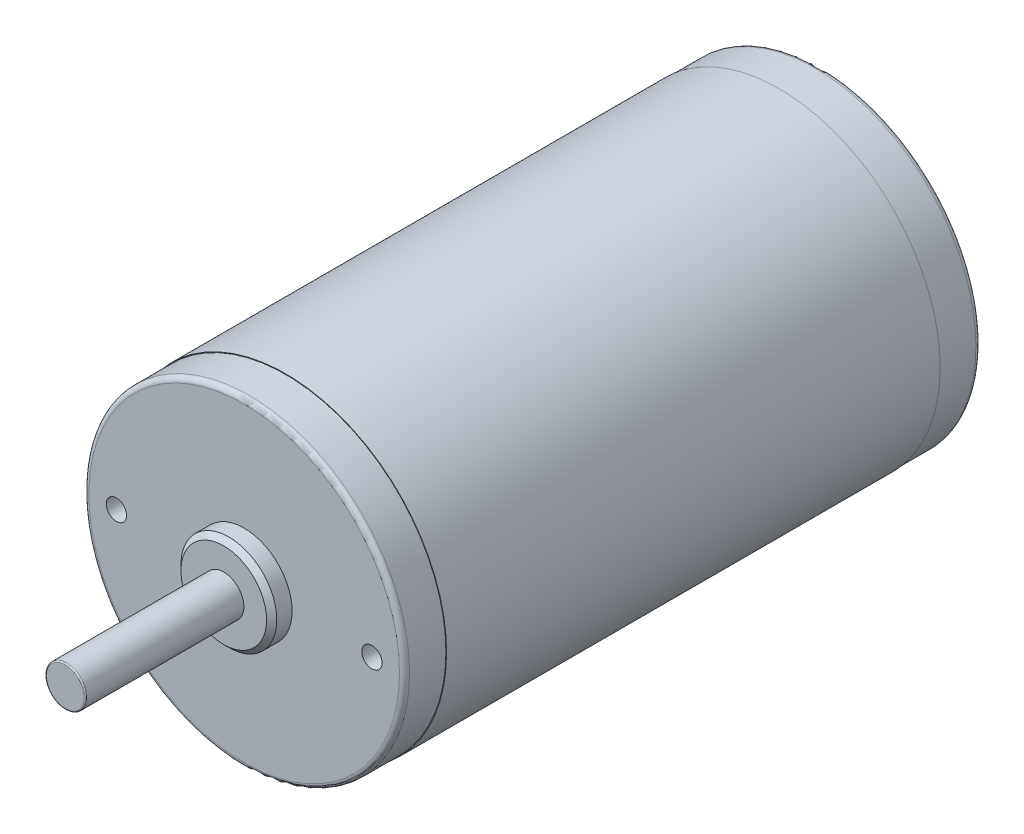
ISO-10303-21;
HEADER;
FILE_DESCRIPTION(('STEP AP214'),'2;1');
FILE_NAME('part.step','',(''),(''),'','','');
FILE_SCHEMA(('AUTOMOTIVE_DESIGN { 1 0 10303 214 1 1 1 1 }'));
ENDSEC;
DATA;
#1=APPLICATION_CONTEXT('core data for automotive mechanical design processes');
#2=APPLICATION_PROTOCOL_DEFINITION('international standard','automotive_design',2000,#1);
#3=PRODUCT_CONTEXT('',#1,'mechanical');
#4=PRODUCT('Part','Part','',(#3));
#5=PRODUCT_RELATED_PRODUCT_CATEGORY('part','',(#4));
#6=PRODUCT_DEFINITION_FORMATION('','',#4);
#7=PRODUCT_DEFINITION_CONTEXT('part definition',#1,'design');
#8=PRODUCT_DEFINITION('design','',#6,#7);
#9=PRODUCT_DEFINITION_SHAPE('','',#8);
#10=(LENGTH_UNIT() NAMED_UNIT(*) SI_UNIT(.MILLI.,.METRE.));
#11=(NAMED_UNIT(*) PLANE_ANGLE_UNIT() SI_UNIT($,.RADIAN.));
#12=(NAMED_UNIT(*) SI_UNIT($,.STERADIAN.) SOLID_ANGLE_UNIT());
#13=UNCERTAINTY_MEASURE_WITH_UNIT(LENGTH_MEASURE(1.E-05),#10,'distance_accuracy_value','');
#14=(GEOMETRIC_REPRESENTATION_CONTEXT(3) GLOBAL_UNCERTAINTY_ASSIGNED_CONTEXT((#13)) GLOBAL_UNIT_ASSIGNED_CONTEXT((#10,
#11,#12)) REPRESENTATION_CONTEXT('',''));
#15=CARTESIAN_POINT('',(0.,0.,0.));
#16=DIRECTION('',(0.,0.,1.));
#17=DIRECTION('',(1.,0.,0.));
#18=AXIS2_PLACEMENT_3D('',#15,#16,#17);
#19=CARTESIAN_POINT('',(35.56,109.2962,-95.5547999999977));
#20=DIRECTION('',(0.,0.,-0.999999999999999));
#21=DIRECTION('',(-1.,0.,0.));
#22=AXIS2_PLACEMENT_3D('',#19,#20,#21);
#23=PLANE('',#22);
#24=CARTESIAN_POINT('',(35.56,109.2962,-95.5547999999977));
#25=DIRECTION('',(0.,0.,-0.999999999999999));
#26=DIRECTION('',(-1.,0.,0.));
#27=AXIS2_PLACEMENT_3D('',#24,#25,#26);
#28=CIRCLE('',#27,30.8770000000005);
#29=CARTESIAN_POINT('',(4.68299999999951,109.2962,-95.5547999999977));
#30=VERTEX_POINT('',#29);
#31=EDGE_CURVE('E104',#30,#30,#28,.T.);
#32=ORIENTED_EDGE('',*,*,#31,.T.);
#33=EDGE_LOOP('',(#32));
#34=FACE_BOUND('',#33,.T.);
#35=CARTESIAN_POINT('',(35.56,109.2962,-95.5547999999977));
#36=DIRECTION('',(0.,0.,-0.999999999999999));
#37=DIRECTION('',(-1.,0.,0.));
#38=AXIS2_PLACEMENT_3D('',#35,#36,#37);
#39=CIRCLE('',#38,15.0368000000003);
#40=CARTESIAN_POINT('',(20.5231999999997,109.2962,-95.5547999999977));
#41=VERTEX_POINT('',#40);
#42=EDGE_CURVE('E71',#41,#41,#39,.T.);
#43=ORIENTED_EDGE('',*,*,#42,.F.);
#44=EDGE_LOOP('',(#43));
#45=FACE_BOUND('',#44,.T.);
#46=ADVANCED_FACE('F36',(#34,#45),#23,.T.);
#47=CARTESIAN_POINT('',(35.56,109.2962,-87.3251999999978));
#48=DIRECTION('',(0.,0.,-0.999999999999999));
#49=DIRECTION('',(-1.,0.,0.));
#50=AXIS2_PLACEMENT_3D('',#47,#48,#49);
#51=PLANE('',#50);
#52=CARTESIAN_POINT('',(35.56,109.2962,-87.3251999999978));
#53=DIRECTION('',(0.,0.,-0.999999999999999));
#54=DIRECTION('',(-1.,0.,0.));
#55=AXIS2_PLACEMENT_3D('',#52,#53,#54);
#56=CIRCLE('',#55,32.0040000000005);
#57=CARTESIAN_POINT('',(3.55599999999952,109.2962,-87.3251999999978));
#58=VERTEX_POINT('',#57);
#59=EDGE_CURVE('E83',#58,#58,#56,.T.);
#60=ORIENTED_EDGE('',*,*,#59,.T.);
#61=EDGE_LOOP('',(#60));
#62=FACE_BOUND('',#61,.T.);
#63=CARTESIAN_POINT('',(35.56,109.2962,-87.3251999999978));
#64=DIRECTION('',(0.,0.,-0.999999999999999));
#65=DIRECTION('',(-1.,0.,0.));
#66=AXIS2_PLACEMENT_3D('',#63,#64,#65);
#67=CIRCLE('',#66,31.8770000000005);
#68=CARTESIAN_POINT('',(3.68299999999951,109.2962,-87.3251999999978));
#69=VERTEX_POINT('',#68);
#70=EDGE_CURVE('E74',#69,#69,#67,.T.);
#71=ORIENTED_EDGE('',*,*,#70,.F.);
#72=EDGE_LOOP('',(#71));
#73=FACE_BOUND('',#72,.T.);
#74=ADVANCED_FACE('F130',(#62,#73),#51,.T.);
#75=CARTESIAN_POINT('',(35.56,109.2962,23.1140000000001));
#76=DIRECTION('',(0.,0.,0.999999999999999));
#77=DIRECTION('',(1.,0.,0.));
#78=AXIS2_PLACEMENT_3D('',#75,#76,#77);
#79=PLANE('',#78);
#80=CARTESIAN_POINT('',(35.56,109.2962,23.1140000000001));
#81=DIRECTION('',(0.,0.,0.999999999999999));
#82=DIRECTION('',(1.,0.,0.));
#83=AXIS2_PLACEMENT_3D('',#80,#81,#82);
#84=CIRCLE('',#83,8.50900000182338);
#85=CARTESIAN_POINT('',(44.0690000018234,109.2962,23.1140000000001));
#86=VERTEX_POINT('',#85);
#87=EDGE_CURVE('E95',#86,#86,#84,.T.);
#88=ORIENTED_EDGE('',*,*,#87,.T.);
#89=EDGE_LOOP('',(#88));
#90=FACE_BOUND('',#89,.T.);
#91=CARTESIAN_POINT('',(35.56,109.2962,23.1140000000001));
#92=DIRECTION('',(0.,0.,0.999999999999999));
#93=DIRECTION('',(1.,0.,0.));
#94=AXIS2_PLACEMENT_3D('',#91,#92,#93);
#95=CIRCLE('',#94,4.00000000000007);
#96=CARTESIAN_POINT('',(39.5600000000001,109.2962,23.1140000000001));
#97=VERTEX_POINT('',#96);
#98=EDGE_CURVE('E77',#97,#97,#95,.T.);
#99=ORIENTED_EDGE('',*,*,#98,.F.);
#100=EDGE_LOOP('',(#99));
#101=FACE_BOUND('',#100,.T.);
#102=ADVANCED_FACE('F136',(#90,#101),#79,.T.);
#103=CARTESIAN_POINT('',(67.5640000000005,109.2962,10.8204000000007));
#104=DIRECTION('',(0.,0.,0.999999999999999));
#105=DIRECTION('',(1.,0.,0.));
#106=AXIS2_PLACEMENT_3D('',#103,#104,#105);
#107=PLANE('',#106);
#108=CARTESIAN_POINT('',(35.56,109.2962,10.8204000000007));
#109=DIRECTION('',(0.,0.,-0.999999999999999));
#110=DIRECTION('',(-1.,0.,0.));
#111=AXIS2_PLACEMENT_3D('',#108,#109,#110);
#112=CIRCLE('',#111,32.0040000000005);
#113=CARTESIAN_POINT('',(3.55599999999952,109.2962,10.8204000000007));
#114=VERTEX_POINT('',#113);
#115=EDGE_CURVE('E86',#114,#114,#112,.T.);
#116=ORIENTED_EDGE('',*,*,#115,.F.);
#117=EDGE_LOOP('',(#116));
#118=FACE_BOUND('',#117,.T.);
#119=CARTESIAN_POINT('',(35.56,109.2962,10.8204000000007));
#120=DIRECTION('',(0.,0.,0.999999999999999));
#121=DIRECTION('',(1.,0.,0.));
#122=AXIS2_PLACEMENT_3D('',#119,#120,#121);
#123=CIRCLE('',#122,31.8770000000005);
#124=CARTESIAN_POINT('',(67.4370000000005,109.2962,10.8204000000007));
#125=VERTEX_POINT('',#124);
#126=EDGE_CURVE('E80',#125,#125,#123,.T.);
#127=ORIENTED_EDGE('',*,*,#126,.F.);
#128=EDGE_LOOP('',(#127));
#129=FACE_BOUND('',#128,.T.);
#130=ADVANCED_FACE('F159',(#118,#129),#107,.T.);
#131=CARTESIAN_POINT('',(35.56,109.2962,10.8204000000007));
#132=DIRECTION('',(0.,0.,-0.999999999999999));
#133=DIRECTION('',(-1.,0.,0.));
#134=AXIS2_PLACEMENT_3D('',#131,#132,#133);
#135=CYLINDRICAL_SURFACE('',#134,32.0040000000005);
#136=ORIENTED_EDGE('',*,*,#115,.T.);
#137=EDGE_LOOP('',(#136));
#138=FACE_BOUND('',#137,.T.);
#139=ORIENTED_EDGE('',*,*,#59,.F.);
#140=EDGE_LOOP('',(#139));
#141=FACE_BOUND('',#140,.T.);
#142=ADVANCED_FACE('F170',(#138,#141),#135,.T.);
#143=CARTESIAN_POINT('',(35.56,109.2962,19.05));
#144=DIRECTION('',(0.,0.,-0.999999999999999));
#145=DIRECTION('',(-1.,0.,0.));
#146=AXIS2_PLACEMENT_3D('',#143,#144,#145);
#147=CYLINDRICAL_SURFACE('',#146,31.8770000000005);
#148=CARTESIAN_POINT('',(35.56,109.2962,18.0499999999999));
#149=DIRECTION('',(0.,0.,0.999999999999999));
#150=DIRECTION('',(1.,0.,0.));
#151=AXIS2_PLACEMENT_3D('',#148,#149,#150);
#152=CIRCLE('',#151,31.8770000000005);
#153=CARTESIAN_POINT('',(67.4370000000005,109.2962,18.0499999999999));
#154=VERTEX_POINT('',#153);
#155=EDGE_CURVE('E113',#154,#154,#152,.F.);
#156=ORIENTED_EDGE('',*,*,#155,.T.);
#157=EDGE_LOOP('',(#156));
#158=FACE_BOUND('',#157,.T.);
#159=ORIENTED_EDGE('',*,*,#126,.T.);
#160=EDGE_LOOP('',(#159));
#161=FACE_BOUND('',#160,.T.);
#162=ADVANCED_FACE('F167',(#158,#161),#147,.T.);
#163=CARTESIAN_POINT('',(35.56,109.2962,19.05));
#164=DIRECTION('',(0.,0.,0.999999999999999));
#165=DIRECTION('',(1.,0.,0.));
#166=AXIS2_PLACEMENT_3D('',#163,#164,#165);
#167=PLANE('',#166);
#168=CARTESIAN_POINT('',(35.56,109.2962,19.05));
#169=DIRECTION('',(0.,0.,0.999999999999999));
#170=DIRECTION('',(1.,0.,0.));
#171=AXIS2_PLACEMENT_3D('',#168,#169,#170);
#172=CIRCLE('',#171,30.8770000000005);
#173=CARTESIAN_POINT('',(66.4370000000005,109.2962,19.05));
#174=VERTEX_POINT('',#173);
#175=EDGE_CURVE('E110',#174,#174,#172,.T.);
#176=ORIENTED_EDGE('',*,*,#175,.T.);
#177=EDGE_LOOP('',(#176));
#178=FACE_BOUND('',#177,.T.);
#179=CARTESIAN_POINT('',(10.1599999999994,109.2962,19.05));
#180=DIRECTION('',(0.,0.,0.999999999999999));
#181=DIRECTION('',(1.,0.,0.));
#182=AXIS2_PLACEMENT_3D('',#179,#180,#181);
#183=CIRCLE('',#182,2.01930000000003);
#184=CARTESIAN_POINT('',(12.1792999999994,109.2962,19.05));
#185=VERTEX_POINT('',#184);
#186=EDGE_CURVE('E61',#185,#185,#183,.T.);
#187=ORIENTED_EDGE('',*,*,#186,.F.);
#188=EDGE_LOOP('',(#187));
#189=FACE_BOUND('',#188,.T.);
#190=CARTESIAN_POINT('',(60.96,109.2962,19.05));
#191=DIRECTION('',(0.,0.,0.999999999999999));
#192=DIRECTION('',(1.,0.,0.));
#193=AXIS2_PLACEMENT_3D('',#190,#191,#192);
#194=CIRCLE('',#193,2.01930000000003);
#195=CARTESIAN_POINT('',(62.9793,109.2962,19.05));
#196=VERTEX_POINT('',#195);
#197=EDGE_CURVE('E60',#196,#196,#194,.T.);
#198=ORIENTED_EDGE('',*,*,#197,.F.);
#199=EDGE_LOOP('',(#198));
#200=FACE_BOUND('',#199,.T.);
#201=CARTESIAN_POINT('',(35.56,109.2962,19.05));
#202=DIRECTION('',(0.,0.,0.999999999999999));
#203=DIRECTION('',(1.,0.,0.));
#204=AXIS2_PLACEMENT_3D('',#201,#202,#203);
#205=CIRCLE('',#204,9.52500000000019);
#206=CARTESIAN_POINT('',(45.0850000000002,109.2962,19.05));
#207=VERTEX_POINT('',#206);
#208=EDGE_CURVE('E89',#207,#207,#205,.T.);
#209=ORIENTED_EDGE('',*,*,#208,.F.);
#210=EDGE_LOOP('',(#209));
#211=FACE_BOUND('',#210,.T.);
#212=ADVANCED_FACE('F163',(#178,#189,#200,#211),#167,.T.);
#213=CARTESIAN_POINT('',(35.56,109.2962,23.1140000000001));
#214=DIRECTION('',(0.,0.,-0.999999999999999));
#215=DIRECTION('',(-1.,0.,0.));
#216=AXIS2_PLACEMENT_3D('',#213,#214,#215);
#217=CYLINDRICAL_SURFACE('',#216,9.52500000000019);
#218=CARTESIAN_POINT('',(35.56,109.2962,22.0979999999995));
#219=DIRECTION('',(0.,0.,0.999999999999999));
#220=DIRECTION('',(1.,0.,0.));
#221=AXIS2_PLACEMENT_3D('',#218,#219,#220);
#222=CIRCLE('',#221,9.52500000000019);
#223=CARTESIAN_POINT('',(45.0850000000002,109.2962,22.0979999999995));
#224=VERTEX_POINT('',#223);
#225=EDGE_CURVE('E92',#224,#224,#222,.F.);
#226=ORIENTED_EDGE('',*,*,#225,.T.);
#227=EDGE_LOOP('',(#226));
#228=FACE_BOUND('',#227,.T.);
#229=ORIENTED_EDGE('',*,*,#208,.T.);
#230=EDGE_LOOP('',(#229));
#231=FACE_BOUND('',#230,.T.);
#232=ADVANCED_FACE('F155',(#228,#231),#217,.T.);
#233=CARTESIAN_POINT('',(35.56,109.2962,54.6139999999999));
#234=DIRECTION('',(0.,0.,-0.999999999999999));
#235=DIRECTION('',(-1.,0.,0.));
#236=AXIS2_PLACEMENT_3D('',#233,#234,#235);
#237=CYLINDRICAL_SURFACE('',#236,4.00000000000007);
#238=CARTESIAN_POINT('',(35.56,109.2962,54.36));
#239=DIRECTION('',(0.,0.,0.999999999999999));
#240=DIRECTION('',(1.,0.,0.));
#241=AXIS2_PLACEMENT_3D('',#238,#239,#240);
#242=CIRCLE('',#241,4.00000000000007);
#243=CARTESIAN_POINT('',(39.5600000000001,109.2962,54.36));
#244=VERTEX_POINT('',#243);
#245=EDGE_CURVE('E101',#244,#244,#242,.F.);
#246=ORIENTED_EDGE('',*,*,#245,.T.);
#247=EDGE_LOOP('',(#246));
#248=FACE_BOUND('',#247,.T.);
#249=ORIENTED_EDGE('',*,*,#98,.T.);
#250=EDGE_LOOP('',(#249));
#251=FACE_BOUND('',#250,.T.);
#252=ADVANCED_FACE('F151',(#248,#251),#237,.T.);
#253=CARTESIAN_POINT('',(35.56,109.2962,54.6139999999999));
#254=DIRECTION('',(0.,0.,0.999999999999999));
#255=DIRECTION('',(1.,0.,0.));
#256=AXIS2_PLACEMENT_3D('',#253,#254,#255);
#257=PLANE('',#256);
#258=CARTESIAN_POINT('',(35.56,109.2962,54.6139999999999));
#259=DIRECTION('',(0.,0.,0.999999999999999));
#260=DIRECTION('',(1.,0.,0.));
#261=AXIS2_PLACEMENT_3D('',#258,#259,#260);
#262=CIRCLE('',#261,3.74600000000007);
#263=CARTESIAN_POINT('',(39.3060000000001,109.2962,54.6139999999999));
#264=VERTEX_POINT('',#263);
#265=EDGE_CURVE('E98',#264,#264,#262,.T.);
#266=ORIENTED_EDGE('',*,*,#265,.T.);
#267=EDGE_LOOP('',(#266));
#268=FACE_BOUND('',#267,.T.);
#269=ADVANCED_FACE('F147',(#268),#257,.T.);
#270=CARTESIAN_POINT('',(35.56,109.2962,-95.5547999999977));
#271=DIRECTION('',(0.,0.,0.999999999999999));
#272=DIRECTION('',(1.,0.,0.));
#273=AXIS2_PLACEMENT_3D('',#270,#271,#272);
#274=CYLINDRICAL_SURFACE('',#273,31.8770000000005);
#275=CARTESIAN_POINT('',(35.56,109.2962,-94.5547999999978));
#276=DIRECTION('',(0.,0.,-0.999999999999999));
#277=DIRECTION('',(-1.,0.,0.));
#278=AXIS2_PLACEMENT_3D('',#275,#276,#277);
#279=CIRCLE('',#278,31.8770000000005);
#280=CARTESIAN_POINT('',(3.68299999999951,109.2962,-94.5547999999978));
#281=VERTEX_POINT('',#280);
#282=EDGE_CURVE('E107',#281,#281,#279,.F.);
#283=ORIENTED_EDGE('',*,*,#282,.T.);
#284=EDGE_LOOP('',(#283));
#285=FACE_BOUND('',#284,.T.);
#286=ORIENTED_EDGE('',*,*,#70,.T.);
#287=EDGE_LOOP('',(#286));
#288=FACE_BOUND('',#287,.T.);
#289=ADVANCED_FACE('F144',(#285,#288),#274,.T.);
#290=CARTESIAN_POINT('',(35.56,109.2962,-100.317299999998));
#291=DIRECTION('',(0.,0.,0.999999999999999));
#292=DIRECTION('',(1.,0.,0.));
#293=AXIS2_PLACEMENT_3D('',#290,#291,#292);
#294=CYLINDRICAL_SURFACE('',#293,15.0368000000003);
#295=CARTESIAN_POINT('',(35.56,109.2962,-99.3172999999978));
#296=DIRECTION('',(0.,0.,-0.999999999999999));
#297=DIRECTION('',(-1.,0.,0.));
#298=AXIS2_PLACEMENT_3D('',#295,#296,#297);
#299=CIRCLE('',#298,15.0368000000003);
#300=CARTESIAN_POINT('',(20.5231999999997,109.2962,-99.3172999999978));
#301=VERTEX_POINT('',#300);
#302=EDGE_CURVE('E11',#301,#301,#299,.F.);
#303=ORIENTED_EDGE('',*,*,#302,.T.);
#304=EDGE_LOOP('',(#303));
#305=FACE_BOUND('',#304,.T.);
#306=ORIENTED_EDGE('',*,*,#42,.T.);
#307=EDGE_LOOP('',(#306));
#308=FACE_BOUND('',#307,.T.);
#309=ADVANCED_FACE('F142',(#305,#308),#294,.T.);
#310=CARTESIAN_POINT('',(35.56,109.2962,-100.317299999998));
#311=DIRECTION('',(0.,0.,-0.999999999999999));
#312=DIRECTION('',(-1.,0.,0.));
#313=AXIS2_PLACEMENT_3D('',#310,#311,#312);
#314=PLANE('',#313);
#315=CARTESIAN_POINT('',(35.56,109.2962,-100.317299999998));
#316=DIRECTION('',(0.,0.,-0.999999999999999));
#317=DIRECTION('',(-1.,0.,0.));
#318=AXIS2_PLACEMENT_3D('',#315,#316,#317);
#319=CIRCLE('',#318,14.0368000000003);
#320=CARTESIAN_POINT('',(21.5231999999997,109.2962,-100.317299999998));
#321=VERTEX_POINT('',#320);
#322=EDGE_CURVE('E44',#321,#321,#319,.T.);
#323=ORIENTED_EDGE('',*,*,#322,.T.);
#324=EDGE_LOOP('',(#323));
#325=FACE_BOUND('',#324,.T.);
#326=ADVANCED_FACE('F118',(#325),#314,.T.);
#327=CARTESIAN_POINT('',(60.96,109.2962,5.43560000000065));
#328=DIRECTION('',(0.,0.,0.999999999999999));
#329=DIRECTION('',(1.,0.,0.));
#330=AXIS2_PLACEMENT_3D('',#327,#328,#329);
#331=CONICAL_SURFACE('',#330,2.01930000000003,1.0297442575);
#332=CARTESIAN_POINT('',(60.96,109.2962,4.22228214876452));
#333=VERTEX_POINT('',#332);
#334=VERTEX_LOOP('',#333);
#335=FACE_BOUND('',#334,.T.);
#336=CARTESIAN_POINT('',(60.96,109.2962,5.43560000000065));
#337=DIRECTION('',(0.,0.,0.999999999999999));
#338=DIRECTION('',(1.,0.,0.));
#339=AXIS2_PLACEMENT_3D('',#336,#337,#338);
#340=CIRCLE('',#339,2.01930000000003);
#341=CARTESIAN_POINT('',(62.9793,109.2962,5.43560000000065));
#342=VERTEX_POINT('',#341);
#343=EDGE_CURVE('E64',#342,#342,#340,.T.);
#344=ORIENTED_EDGE('',*,*,#343,.T.);
#345=EDGE_LOOP('',(#344));
#346=FACE_BOUND('',#345,.T.);
#347=ADVANCED_FACE('F220',(#335,#346),#331,.F.);
#348=CARTESIAN_POINT('',(60.96,109.2962,19.05));
#349=DIRECTION('',(0.,0.,0.999999999999999));
#350=DIRECTION('',(1.,0.,0.));
#351=AXIS2_PLACEMENT_3D('',#348,#349,#350);
#352=CYLINDRICAL_SURFACE('',#351,2.01930000000003);
#353=ORIENTED_EDGE('',*,*,#343,.F.);
#354=EDGE_LOOP('',(#353));
#355=FACE_BOUND('',#354,.T.);
#356=ORIENTED_EDGE('',*,*,#197,.T.);
#357=EDGE_LOOP('',(#356));
#358=FACE_BOUND('',#357,.T.);
#359=ADVANCED_FACE('F54',(#355,#358),#352,.F.);
#360=CARTESIAN_POINT('',(10.1599999999994,109.2962,5.43560000000065));
#361=DIRECTION('',(0.,0.,0.999999999999999));
#362=DIRECTION('',(1.,0.,0.));
#363=AXIS2_PLACEMENT_3D('',#360,#361,#362);
#364=CONICAL_SURFACE('',#363,2.01930000000003,1.0297442575);
#365=CARTESIAN_POINT('',(10.1599999999994,109.2962,4.22228214876452));
#366=VERTEX_POINT('',#365);
#367=VERTEX_LOOP('',#366);
#368=FACE_BOUND('',#367,.T.);
#369=CARTESIAN_POINT('',(10.1599999999994,109.2962,5.43560000000065));
#370=DIRECTION('',(0.,0.,0.999999999999999));
#371=DIRECTION('',(1.,0.,0.));
#372=AXIS2_PLACEMENT_3D('',#369,#370,#371);
#373=CIRCLE('',#372,2.01930000000003);
#374=CARTESIAN_POINT('',(12.1792999999994,109.2962,5.43560000000065));
#375=VERTEX_POINT('',#374);
#376=EDGE_CURVE('E58',#375,#375,#373,.T.);
#377=ORIENTED_EDGE('',*,*,#376,.T.);
#378=EDGE_LOOP('',(#377));
#379=FACE_BOUND('',#378,.T.);
#380=ADVANCED_FACE('F50',(#368,#379),#364,.F.);
#381=CARTESIAN_POINT('',(10.1599999999994,109.2962,19.05));
#382=DIRECTION('',(0.,0.,0.999999999999999));
#383=DIRECTION('',(1.,0.,0.));
#384=AXIS2_PLACEMENT_3D('',#381,#382,#383);
#385=CYLINDRICAL_SURFACE('',#384,2.01930000000003);
#386=ORIENTED_EDGE('',*,*,#376,.F.);
#387=EDGE_LOOP('',(#386));
#388=FACE_BOUND('',#387,.T.);
#389=ORIENTED_EDGE('',*,*,#186,.T.);
#390=EDGE_LOOP('',(#389));
#391=FACE_BOUND('',#390,.T.);
#392=ADVANCED_FACE('F53',(#388,#391),#385,.F.);
#393=CARTESIAN_POINT('',(35.56,109.2962,22.0979999999995));
#394=DIRECTION('',(0.,0.,-0.999999999999999));
#395=DIRECTION('',(-1.,0.,0.));
#396=AXIS2_PLACEMENT_3D('',#393,#394,#395);
#397=CONICAL_SURFACE('',#396,9.52500000000019,0.785398162500005);
#398=ORIENTED_EDGE('',*,*,#87,.F.);
#399=EDGE_LOOP('',(#398));
#400=FACE_BOUND('',#399,.T.);
#401=ORIENTED_EDGE('',*,*,#225,.F.);
#402=EDGE_LOOP('',(#401));
#403=FACE_BOUND('',#402,.T.);
#404=ADVANCED_FACE('F179',(#400,#403),#397,.T.);
#405=CARTESIAN_POINT('',(35.56,109.2962,54.36));
#406=DIRECTION('',(0.,0.,0.999999999999999));
#407=DIRECTION('',(1.,0.,0.));
#408=AXIS2_PLACEMENT_3D('',#405,#406,#407);
#409=TOROIDAL_SURFACE('',#408,3.74600000000007,0.254);
#410=ORIENTED_EDGE('',*,*,#245,.F.);
#411=EDGE_LOOP('',(#410));
#412=FACE_BOUND('',#411,.T.);
#413=ORIENTED_EDGE('',*,*,#265,.F.);
#414=EDGE_LOOP('',(#413));
#415=FACE_BOUND('',#414,.T.);
#416=ADVANCED_FACE('F182',(#412,#415),#409,.T.);
#417=CARTESIAN_POINT('',(35.56,109.2962,-94.5547999999978));
#418=DIRECTION('',(0.,0.,-0.999999999999999));
#419=DIRECTION('',(-1.,0.,0.));
#420=AXIS2_PLACEMENT_3D('',#417,#418,#419);
#421=TOROIDAL_SURFACE('',#420,30.8770000000005,1.);
#422=ORIENTED_EDGE('',*,*,#282,.F.);
#423=EDGE_LOOP('',(#422));
#424=FACE_BOUND('',#423,.T.);
#425=ORIENTED_EDGE('',*,*,#31,.F.);
#426=EDGE_LOOP('',(#425));
#427=FACE_BOUND('',#426,.T.);
#428=ADVANCED_FACE('F126',(#424,#427),#421,.T.);
#429=CARTESIAN_POINT('',(35.56,109.2962,18.0499999999999));
#430=DIRECTION('',(0.,0.,0.999999999999999));
#431=DIRECTION('',(1.,0.,0.));
#432=AXIS2_PLACEMENT_3D('',#429,#430,#431);
#433=TOROIDAL_SURFACE('',#432,30.8770000000005,1.);
#434=ORIENTED_EDGE('',*,*,#155,.F.);
#435=EDGE_LOOP('',(#434));
#436=FACE_BOUND('',#435,.T.);
#437=ORIENTED_EDGE('',*,*,#175,.F.);
#438=EDGE_LOOP('',(#437));
#439=FACE_BOUND('',#438,.T.);
#440=ADVANCED_FACE('F121',(#436,#439),#433,.T.);
#441=CARTESIAN_POINT('',(35.56,109.2962,-99.3172999999978));
#442=DIRECTION('',(0.,0.,-0.999999999999999));
#443=DIRECTION('',(-1.,0.,0.));
#444=AXIS2_PLACEMENT_3D('',#441,#442,#443);
#445=TOROIDAL_SURFACE('',#444,14.0368000000003,1.);
#446=ORIENTED_EDGE('',*,*,#302,.F.);
#447=EDGE_LOOP('',(#446));
#448=FACE_BOUND('',#447,.T.);
#449=ORIENTED_EDGE('',*,*,#322,.F.);
#450=EDGE_LOOP('',(#449));
#451=FACE_BOUND('',#450,.T.);
#452=ADVANCED_FACE('F38',(#448,#451),#445,.T.);
#453=CLOSED_SHELL('',(#46,#74,#102,#130,#142,#162,#212,#232,#252,#269,#289,#309,#326,#347,#359,
#380,#392,#404,#416,#428,#440,#452));
#454=MANIFOLD_SOLID_BREP('B2',#453);
#455=ADVANCED_BREP_SHAPE_REPRESENTATION('',(#18,#454),#14);
#456=SHAPE_DEFINITION_REPRESENTATION(#9,#455);
ENDSEC;
END-ISO-10303-21;
